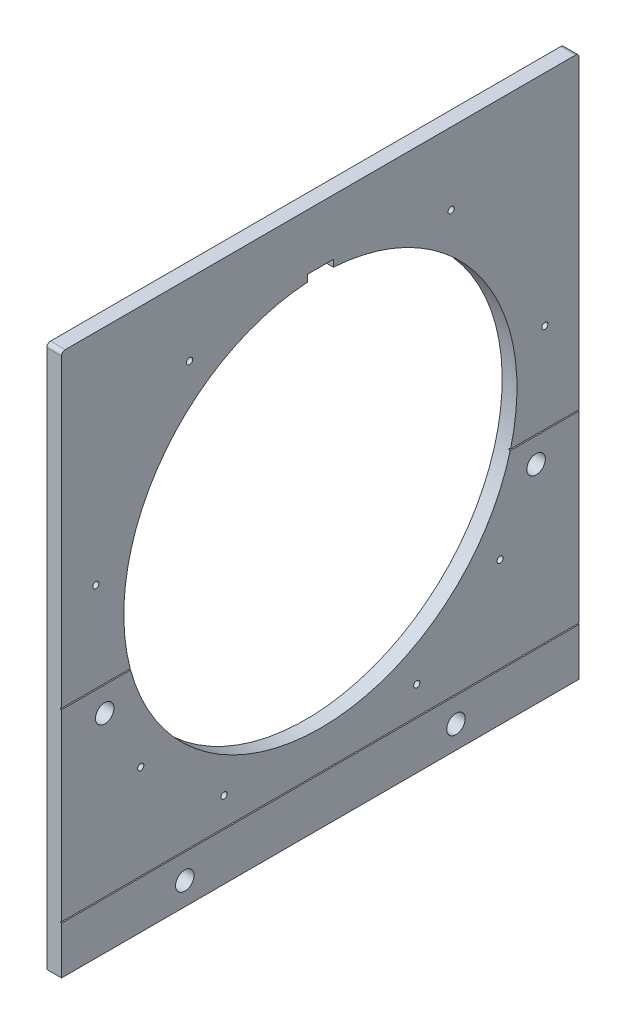
ISO-10303-21;
HEADER;
FILE_DESCRIPTION(('STEP AP214'),'2;1');
FILE_NAME('part.step','',(''),(''),'','','');
FILE_SCHEMA(('AUTOMOTIVE_DESIGN { 1 0 10303 214 1 1 1 1 }'));
ENDSEC;
DATA;
#1=APPLICATION_CONTEXT('core data for automotive mechanical design processes');
#2=APPLICATION_PROTOCOL_DEFINITION('international standard','automotive_design',2000,#1);
#3=PRODUCT_CONTEXT('',#1,'mechanical');
#4=PRODUCT('Part','Part','',(#3));
#5=PRODUCT_RELATED_PRODUCT_CATEGORY('part','',(#4));
#6=PRODUCT_DEFINITION_FORMATION('','',#4);
#7=PRODUCT_DEFINITION_CONTEXT('part definition',#1,'design');
#8=PRODUCT_DEFINITION('design','',#6,#7);
#9=PRODUCT_DEFINITION_SHAPE('','',#8);
#10=(LENGTH_UNIT() NAMED_UNIT(*) SI_UNIT(.MILLI.,.METRE.));
#11=(NAMED_UNIT(*) PLANE_ANGLE_UNIT() SI_UNIT($,.RADIAN.));
#12=(NAMED_UNIT(*) SI_UNIT($,.STERADIAN.) SOLID_ANGLE_UNIT());
#13=UNCERTAINTY_MEASURE_WITH_UNIT(LENGTH_MEASURE(1.E-05),#10,'distance_accuracy_value','');
#14=(GEOMETRIC_REPRESENTATION_CONTEXT(3) GLOBAL_UNCERTAINTY_ASSIGNED_CONTEXT((#13)) GLOBAL_UNIT_ASSIGNED_CONTEXT((#10,
#11,#12)) REPRESENTATION_CONTEXT('',''));
#15=CARTESIAN_POINT('',(0.,0.,0.));
#16=DIRECTION('',(0.,0.,1.));
#17=DIRECTION('',(1.,0.,0.));
#18=AXIS2_PLACEMENT_3D('',#15,#16,#17);
#19=CARTESIAN_POINT('',(0.,0.,0.));
#20=DIRECTION('',(-1.,0.,0.));
#21=DIRECTION('',(0.,0.,1.));
#22=AXIS2_PLACEMENT_3D('',#19,#20,#21);
#23=PLANE('',#22);
#24=CARTESIAN_POINT('',(0.,161.543128193462,106.111640724945));
#25=DIRECTION('',(1.,0.,0.));
#26=DIRECTION('',(0.,0.,-1.));
#27=AXIS2_PLACEMENT_3D('',#24,#25,#26);
#28=CIRCLE('',#27,2.50000000000001);
#29=CARTESIAN_POINT('',(0.,161.543128193462,103.611640724945));
#30=VERTEX_POINT('',#29);
#31=EDGE_CURVE('E817',#30,#30,#28,.T.);
#32=ORIENTED_EDGE('',*,*,#31,.F.);
#33=EDGE_LOOP('',(#32));
#34=FACE_BOUND('',#33,.T.);
#35=CARTESIAN_POINT('',(0.,42.1249128683808,182.189434307259));
#36=DIRECTION('',(1.,0.,0.));
#37=DIRECTION('',(0.,0.,-1.));
#38=AXIS2_PLACEMENT_3D('',#35,#36,#37);
#39=CIRCLE('',#38,2.5);
#40=CARTESIAN_POINT('',(0.,42.1249128683808,179.689434307259));
#41=VERTEX_POINT('',#40);
#42=EDGE_CURVE('E278',#41,#41,#39,.T.);
#43=ORIENTED_EDGE('',*,*,#42,.F.);
#44=EDGE_LOOP('',(#43));
#45=FACE_BOUND('',#44,.T.);
#46=CARTESIAN_POINT('',(0.,161.543128193462,-106.111640724945));
#47=DIRECTION('',(-1.,0.,0.));
#48=DIRECTION('',(0.,0.,1.));
#49=AXIS2_PLACEMENT_3D('',#46,#47,#48);
#50=CIRCLE('',#49,2.50000000000001);
#51=CARTESIAN_POINT('',(0.,161.543128193462,-103.611640724945));
#52=VERTEX_POINT('',#51);
#53=EDGE_CURVE('E292',#52,#52,#50,.T.);
#54=ORIENTED_EDGE('',*,*,#53,.T.);
#55=EDGE_LOOP('',(#54));
#56=FACE_BOUND('',#55,.T.);
#57=CARTESIAN_POINT('',(0.,42.1249128683808,-182.189434307259));
#58=DIRECTION('',(-1.,0.,0.));
#59=DIRECTION('',(0.,0.,1.));
#60=AXIS2_PLACEMENT_3D('',#57,#58,#59);
#61=CIRCLE('',#60,2.5);
#62=CARTESIAN_POINT('',(0.,42.1249128683808,-179.689434307259));
#63=VERTEX_POINT('',#62);
#64=EDGE_CURVE('E514',#63,#63,#61,.T.);
#65=ORIENTED_EDGE('',*,*,#64,.T.);
#66=EDGE_LOOP('',(#65));
#67=FACE_BOUND('',#66,.T.);
#68=DIRECTION('',(0.,-1.,0.));
#69=VECTOR('',#68,1.);
#70=CARTESIAN_POINT('',(0.,-220.,210.));
#71=LINE('',#70,#69);
#72=CARTESIAN_POINT('',(0.,217.,210.));
#73=VERTEX_POINT('',#72);
#74=CARTESIAN_POINT('',(0.,-30.5,210.));
#75=VERTEX_POINT('',#74);
#76=EDGE_CURVE('E429',#73,#75,#71,.T.);
#77=ORIENTED_EDGE('',*,*,#76,.T.);
#78=DIRECTION('',(0.,0.,1.));
#79=VECTOR('',#78,1.);
#80=CARTESIAN_POINT('',(0.,-30.5,210.));
#81=LINE('',#80,#79);
#82=CARTESIAN_POINT('',(0.,-30.5,154.272486205415));
#83=VERTEX_POINT('',#82);
#84=EDGE_CURVE('E424',#83,#75,#81,.T.);
#85=ORIENTED_EDGE('',*,*,#84,.F.);
#86=CARTESIAN_POINT('',(0.,9.99999999999998,0.));
#87=DIRECTION('',(1.,0.,0.));
#88=DIRECTION('',(0.,0.,-1.));
#89=AXIS2_PLACEMENT_3D('',#86,#87,#88);
#90=CIRCLE('',#89,159.5);
#91=CARTESIAN_POINT('',(0.,169.154013458662,10.5));
#92=VERTEX_POINT('',#91);
#93=EDGE_CURVE('E390',#92,#83,#90,.T.);
#94=ORIENTED_EDGE('',*,*,#93,.F.);
#95=DIRECTION('',(0.,-1.,0.));
#96=VECTOR('',#95,1.);
#97=CARTESIAN_POINT('',(0.,169.154013458662,10.5));
#98=LINE('',#97,#96);
#99=CARTESIAN_POINT('',(0.,174.654013458662,10.5));
#100=VERTEX_POINT('',#99);
#101=EDGE_CURVE('E779',#100,#92,#98,.T.);
#102=ORIENTED_EDGE('',*,*,#101,.F.);
#103=DIRECTION('',(0.,0.,1.));
#104=VECTOR('',#103,1.);
#105=CARTESIAN_POINT('',(0.,174.654013458662,-10.5));
#106=LINE('',#105,#104);
#107=CARTESIAN_POINT('',(0.,174.654013458662,-10.5));
#108=VERTEX_POINT('',#107);
#109=EDGE_CURVE('E797',#108,#100,#106,.T.);
#110=ORIENTED_EDGE('',*,*,#109,.F.);
#111=DIRECTION('',(0.,1.,0.));
#112=VECTOR('',#111,1.);
#113=CARTESIAN_POINT('',(0.,174.654013458662,-10.5));
#114=LINE('',#113,#112);
#115=CARTESIAN_POINT('',(0.,169.154013458662,-10.5));
#116=VERTEX_POINT('',#115);
#117=EDGE_CURVE('E277',#116,#108,#114,.T.);
#118=ORIENTED_EDGE('',*,*,#117,.F.);
#119=CARTESIAN_POINT('',(0.,-30.5,-154.272486205415));
#120=VERTEX_POINT('',#119);
#121=EDGE_CURVE('E400',#120,#116,#90,.T.);
#122=ORIENTED_EDGE('',*,*,#121,.F.);
#123=CARTESIAN_POINT('',(0.,-30.5,-210.));
#124=VERTEX_POINT('',#123);
#125=EDGE_CURVE('E208',#124,#120,#81,.T.);
#126=ORIENTED_EDGE('',*,*,#125,.F.);
#127=DIRECTION('',(0.,1.,0.));
#128=VECTOR('',#127,1.);
#129=CARTESIAN_POINT('',(0.,-220.,-210.));
#130=LINE('',#129,#128);
#131=CARTESIAN_POINT('',(0.,217.,-210.));
#132=VERTEX_POINT('',#131);
#133=EDGE_CURVE('E370',#124,#132,#130,.T.);
#134=ORIENTED_EDGE('',*,*,#133,.T.);
#135=CARTESIAN_POINT('',(0.,217.,-207.));
#136=DIRECTION('',(-1.,0.,0.));
#137=DIRECTION('',(0.,0.,1.));
#138=AXIS2_PLACEMENT_3D('',#135,#136,#137);
#139=CIRCLE('',#138,3.);
#140=CARTESIAN_POINT('',(0.,220.,-207.));
#141=VERTEX_POINT('',#140);
#142=EDGE_CURVE('E452',#132,#141,#139,.F.);
#143=ORIENTED_EDGE('',*,*,#142,.T.);
#144=DIRECTION('',(0.,0.,1.));
#145=VECTOR('',#144,1.);
#146=CARTESIAN_POINT('',(0.,220.,210.));
#147=LINE('',#146,#145);
#148=CARTESIAN_POINT('',(0.,220.,207.));
#149=VERTEX_POINT('',#148);
#150=EDGE_CURVE('E367',#141,#149,#147,.T.);
#151=ORIENTED_EDGE('',*,*,#150,.T.);
#152=CARTESIAN_POINT('',(0.,217.,207.));
#153=DIRECTION('',(-1.,0.,0.));
#154=DIRECTION('',(0.,0.,1.));
#155=AXIS2_PLACEMENT_3D('',#152,#153,#154);
#156=CIRCLE('',#155,3.);
#157=EDGE_CURVE('E449',#149,#73,#156,.F.);
#158=ORIENTED_EDGE('',*,*,#157,.T.);
#159=EDGE_LOOP('',(#77,#85,#94,#102,#110,#118,#122,#126,#134,#143,#151,#158));
#160=FACE_BOUND('',#159,.T.);
#161=ADVANCED_FACE('F42',(#34,#45,#56,#67,#160),#23,.F.);
#162=CARTESIAN_POINT('',(0.,-201.5,110.));
#163=DIRECTION('',(1.,0.,0.));
#164=DIRECTION('',(0.,0.,-1.));
#165=AXIS2_PLACEMENT_3D('',#162,#163,#164);
#166=CIRCLE('',#165,7.5);
#167=CARTESIAN_POINT('',(0.,-201.5,102.5));
#168=VERTEX_POINT('',#167);
#169=EDGE_CURVE('E265',#168,#168,#166,.T.);
#170=ORIENTED_EDGE('',*,*,#169,.F.);
#171=EDGE_LOOP('',(#170));
#172=FACE_BOUND('',#171,.T.);
#173=CARTESIAN_POINT('',(0.,-201.5,-110.));
#174=DIRECTION('',(-1.,0.,0.));
#175=DIRECTION('',(0.,0.,1.));
#176=AXIS2_PLACEMENT_3D('',#173,#174,#175);
#177=CIRCLE('',#176,7.5);
#178=CARTESIAN_POINT('',(0.,-201.5,-102.5));
#179=VERTEX_POINT('',#178);
#180=EDGE_CURVE('E355',#179,#179,#177,.T.);
#181=ORIENTED_EDGE('',*,*,#180,.T.);
#182=EDGE_LOOP('',(#181));
#183=FACE_BOUND('',#182,.T.);
#184=CARTESIAN_POINT('',(0.,-220.,-210.));
#185=VERTEX_POINT('',#184);
#186=CARTESIAN_POINT('',(0.,-181.5,-210.));
#187=VERTEX_POINT('',#186);
#188=EDGE_CURVE('E360',#185,#187,#130,.T.);
#189=ORIENTED_EDGE('',*,*,#188,.T.);
#190=DIRECTION('',(0.,0.,-1.));
#191=VECTOR('',#190,1.);
#192=CARTESIAN_POINT('',(0.,-181.5,-210.));
#193=LINE('',#192,#191);
#194=CARTESIAN_POINT('',(0.,-181.5,210.));
#195=VERTEX_POINT('',#194);
#196=EDGE_CURVE('E230',#195,#187,#193,.T.);
#197=ORIENTED_EDGE('',*,*,#196,.F.);
#198=CARTESIAN_POINT('',(0.,-220.,210.));
#199=VERTEX_POINT('',#198);
#200=EDGE_CURVE('E375',#195,#199,#71,.T.);
#201=ORIENTED_EDGE('',*,*,#200,.T.);
#202=DIRECTION('',(0.,0.,-1.));
#203=VECTOR('',#202,1.);
#204=CARTESIAN_POINT('',(0.,-220.,210.));
#205=LINE('',#204,#203);
#206=EDGE_CURVE('E363',#199,#185,#205,.T.);
#207=ORIENTED_EDGE('',*,*,#206,.T.);
#208=EDGE_LOOP('',(#189,#197,#201,#207));
#209=FACE_BOUND('',#208,.T.);
#210=ADVANCED_FACE('F346',(#172,#183,#209),#23,.F.);
#211=CARTESIAN_POINT('',(-12.,-220.,-210.));
#212=DIRECTION('',(0.,0.,-1.));
#213=DIRECTION('',(-1.,0.,0.));
#214=AXIS2_PLACEMENT_3D('',#211,#212,#213);
#215=PLANE('',#214);
#216=DIRECTION('',(1.,0.,0.));
#217=VECTOR('',#216,1.);
#218=CARTESIAN_POINT('',(-1.,-30.5,-210.));
#219=LINE('',#218,#217);
#220=CARTESIAN_POINT('',(-1.,-30.5,-210.));
#221=VERTEX_POINT('',#220);
#222=EDGE_CURVE('E219',#221,#124,#219,.T.);
#223=ORIENTED_EDGE('',*,*,#222,.F.);
#224=DIRECTION('',(0.,1.,0.));
#225=VECTOR('',#224,1.);
#226=CARTESIAN_POINT('',(-1.,-31.5,-210.));
#227=LINE('',#226,#225);
#228=CARTESIAN_POINT('',(-1.,-31.5,-210.));
#229=VERTEX_POINT('',#228);
#230=EDGE_CURVE('E196',#229,#221,#227,.T.);
#231=ORIENTED_EDGE('',*,*,#230,.F.);
#232=DIRECTION('',(1.,0.,0.));
#233=VECTOR('',#232,1.);
#234=CARTESIAN_POINT('',(-1.,-31.5,-210.));
#235=LINE('',#234,#233);
#236=CARTESIAN_POINT('',(0.,-31.5,-210.));
#237=VERTEX_POINT('',#236);
#238=EDGE_CURVE('E215',#229,#237,#235,.T.);
#239=ORIENTED_EDGE('',*,*,#238,.T.);
#240=CARTESIAN_POINT('',(0.,-180.5,-210.));
#241=VERTEX_POINT('',#240);
#242=EDGE_CURVE('E368',#241,#237,#130,.T.);
#243=ORIENTED_EDGE('',*,*,#242,.F.);
#244=DIRECTION('',(1.,0.,0.));
#245=VECTOR('',#244,1.);
#246=CARTESIAN_POINT('',(-1.,-180.5,-210.));
#247=LINE('',#246,#245);
#248=CARTESIAN_POINT('',(-1.,-180.5,-210.));
#249=VERTEX_POINT('',#248);
#250=EDGE_CURVE('E57',#249,#241,#247,.T.);
#251=ORIENTED_EDGE('',*,*,#250,.F.);
#252=DIRECTION('',(0.,1.,0.));
#253=VECTOR('',#252,1.);
#254=CARTESIAN_POINT('',(-1.,-181.5,-210.));
#255=LINE('',#254,#253);
#256=CARTESIAN_POINT('',(-1.,-181.5,-210.));
#257=VERTEX_POINT('',#256);
#258=EDGE_CURVE('E224',#257,#249,#255,.T.);
#259=ORIENTED_EDGE('',*,*,#258,.F.);
#260=DIRECTION('',(1.,0.,0.));
#261=VECTOR('',#260,1.);
#262=CARTESIAN_POINT('',(-1.,-181.5,-210.));
#263=LINE('',#262,#261);
#264=EDGE_CURVE('E585',#257,#187,#263,.T.);
#265=ORIENTED_EDGE('',*,*,#264,.T.);
#266=ORIENTED_EDGE('',*,*,#188,.F.);
#267=DIRECTION('',(1.,0.,0.));
#268=VECTOR('',#267,1.);
#269=CARTESIAN_POINT('',(-12.,-220.,-210.));
#270=LINE('',#269,#268);
#271=CARTESIAN_POINT('',(-12.,-220.,-210.));
#272=VERTEX_POINT('',#271);
#273=EDGE_CURVE('E440',#272,#185,#270,.T.);
#274=ORIENTED_EDGE('',*,*,#273,.F.);
#275=DIRECTION('',(0.,1.,0.));
#276=VECTOR('',#275,1.);
#277=CARTESIAN_POINT('',(-12.,-220.,-210.));
#278=LINE('',#277,#276);
#279=CARTESIAN_POINT('',(-12.,217.,-210.));
#280=VERTEX_POINT('',#279);
#281=EDGE_CURVE('E406',#272,#280,#278,.T.);
#282=ORIENTED_EDGE('',*,*,#281,.T.);
#283=DIRECTION('',(1.,0.,0.));
#284=VECTOR('',#283,1.);
#285=CARTESIAN_POINT('',(-12.,217.,-210.));
#286=LINE('',#285,#284);
#287=EDGE_CURVE('E442',#280,#132,#286,.T.);
#288=ORIENTED_EDGE('',*,*,#287,.T.);
#289=ORIENTED_EDGE('',*,*,#133,.F.);
#290=EDGE_LOOP('',(#223,#231,#239,#243,#251,#259,#265,#266,#274,#282,#288,#289));
#291=FACE_BOUND('',#290,.T.);
#292=ADVANCED_FACE('F349',(#291),#215,.T.);
#293=CARTESIAN_POINT('',(-12.,-220.,210.));
#294=DIRECTION('',(0.,-1.,0.));
#295=DIRECTION('',(0.,0.,-1.));
#296=AXIS2_PLACEMENT_3D('',#293,#294,#295);
#297=PLANE('',#296);
#298=ORIENTED_EDGE('',*,*,#206,.F.);
#299=DIRECTION('',(1.,0.,0.));
#300=VECTOR('',#299,1.);
#301=CARTESIAN_POINT('',(-12.,-220.,210.));
#302=LINE('',#301,#300);
#303=CARTESIAN_POINT('',(-12.,-220.,210.));
#304=VERTEX_POINT('',#303);
#305=EDGE_CURVE('E443',#304,#199,#302,.T.);
#306=ORIENTED_EDGE('',*,*,#305,.F.);
#307=DIRECTION('',(0.,0.,-1.));
#308=VECTOR('',#307,1.);
#309=CARTESIAN_POINT('',(-12.,-220.,210.));
#310=LINE('',#309,#308);
#311=EDGE_CURVE('E446',#304,#272,#310,.T.);
#312=ORIENTED_EDGE('',*,*,#311,.T.);
#313=ORIENTED_EDGE('',*,*,#273,.T.);
#314=EDGE_LOOP('',(#298,#306,#312,#313));
#315=FACE_BOUND('',#314,.T.);
#316=ADVANCED_FACE('F872',(#315),#297,.T.);
#317=CARTESIAN_POINT('',(-12.,-220.,210.));
#318=DIRECTION('',(0.,0.,1.));
#319=DIRECTION('',(1.,0.,0.));
#320=AXIS2_PLACEMENT_3D('',#317,#318,#319);
#321=PLANE('',#320);
#322=DIRECTION('',(1.,0.,0.));
#323=VECTOR('',#322,1.);
#324=CARTESIAN_POINT('',(-1.,-30.5,210.));
#325=LINE('',#324,#323);
#326=CARTESIAN_POINT('',(-1.,-30.5,210.));
#327=VERTEX_POINT('',#326);
#328=EDGE_CURVE('E427',#327,#75,#325,.T.);
#329=ORIENTED_EDGE('',*,*,#328,.T.);
#330=ORIENTED_EDGE('',*,*,#76,.F.);
#331=DIRECTION('',(1.,0.,0.));
#332=VECTOR('',#331,1.);
#333=CARTESIAN_POINT('',(-12.,217.,210.));
#334=LINE('',#333,#332);
#335=CARTESIAN_POINT('',(-12.,217.,210.));
#336=VERTEX_POINT('',#335);
#337=EDGE_CURVE('E463',#73,#336,#334,.F.);
#338=ORIENTED_EDGE('',*,*,#337,.T.);
#339=DIRECTION('',(0.,-1.,0.));
#340=VECTOR('',#339,1.);
#341=CARTESIAN_POINT('',(-12.,-220.,210.));
#342=LINE('',#341,#340);
#343=EDGE_CURVE('E864',#336,#304,#342,.T.);
#344=ORIENTED_EDGE('',*,*,#343,.T.);
#345=ORIENTED_EDGE('',*,*,#305,.T.);
#346=ORIENTED_EDGE('',*,*,#200,.F.);
#347=DIRECTION('',(1.,0.,0.));
#348=VECTOR('',#347,1.);
#349=CARTESIAN_POINT('',(-1.,-181.5,210.));
#350=LINE('',#349,#348);
#351=CARTESIAN_POINT('',(-1.,-181.5,210.));
#352=VERTEX_POINT('',#351);
#353=EDGE_CURVE('E588',#352,#195,#350,.T.);
#354=ORIENTED_EDGE('',*,*,#353,.F.);
#355=DIRECTION('',(0.,-1.,0.));
#356=VECTOR('',#355,1.);
#357=CARTESIAN_POINT('',(-1.,-181.5,210.));
#358=LINE('',#357,#356);
#359=CARTESIAN_POINT('',(-1.,-180.5,210.));
#360=VERTEX_POINT('',#359);
#361=EDGE_CURVE('E242',#360,#352,#358,.T.);
#362=ORIENTED_EDGE('',*,*,#361,.F.);
#363=DIRECTION('',(1.,0.,0.));
#364=VECTOR('',#363,1.);
#365=CARTESIAN_POINT('',(-1.,-180.5,210.));
#366=LINE('',#365,#364);
#367=CARTESIAN_POINT('',(0.,-180.5,210.));
#368=VERTEX_POINT('',#367);
#369=EDGE_CURVE('E589',#360,#368,#366,.T.);
#370=ORIENTED_EDGE('',*,*,#369,.T.);
#371=CARTESIAN_POINT('',(0.,-31.5,210.));
#372=VERTEX_POINT('',#371);
#373=EDGE_CURVE('E214',#372,#368,#71,.T.);
#374=ORIENTED_EDGE('',*,*,#373,.F.);
#375=DIRECTION('',(1.,0.,0.));
#376=VECTOR('',#375,1.);
#377=CARTESIAN_POINT('',(-1.,-31.5,210.));
#378=LINE('',#377,#376);
#379=CARTESIAN_POINT('',(-1.,-31.5,210.));
#380=VERTEX_POINT('',#379);
#381=EDGE_CURVE('E191',#380,#372,#378,.T.);
#382=ORIENTED_EDGE('',*,*,#381,.F.);
#383=DIRECTION('',(0.,-1.,0.));
#384=VECTOR('',#383,1.);
#385=CARTESIAN_POINT('',(-1.,-31.5,210.));
#386=LINE('',#385,#384);
#387=EDGE_CURVE('E200',#327,#380,#386,.T.);
#388=ORIENTED_EDGE('',*,*,#387,.F.);
#389=EDGE_LOOP('',(#329,#330,#338,#344,#345,#346,#354,#362,#370,#374,#382,#388));
#390=FACE_BOUND('',#389,.T.);
#391=ADVANCED_FACE('F211',(#390),#321,.T.);
#392=CARTESIAN_POINT('',(-12.,220.,210.));
#393=DIRECTION('',(0.,1.,0.));
#394=DIRECTION('',(0.,0.,1.));
#395=AXIS2_PLACEMENT_3D('',#392,#393,#394);
#396=PLANE('',#395);
#397=ORIENTED_EDGE('',*,*,#150,.F.);
#398=DIRECTION('',(1.,0.,0.));
#399=VECTOR('',#398,1.);
#400=CARTESIAN_POINT('',(-12.,220.,-207.));
#401=LINE('',#400,#399);
#402=CARTESIAN_POINT('',(-12.,220.,-207.));
#403=VERTEX_POINT('',#402);
#404=EDGE_CURVE('E457',#141,#403,#401,.F.);
#405=ORIENTED_EDGE('',*,*,#404,.T.);
#406=DIRECTION('',(0.,0.,1.));
#407=VECTOR('',#406,1.);
#408=CARTESIAN_POINT('',(-12.,220.,210.));
#409=LINE('',#408,#407);
#410=CARTESIAN_POINT('',(-12.,220.,207.));
#411=VERTEX_POINT('',#410);
#412=EDGE_CURVE('E861',#403,#411,#409,.T.);
#413=ORIENTED_EDGE('',*,*,#412,.T.);
#414=DIRECTION('',(1.,0.,0.));
#415=VECTOR('',#414,1.);
#416=CARTESIAN_POINT('',(-12.,220.,207.));
#417=LINE('',#416,#415);
#418=EDGE_CURVE('E454',#411,#149,#417,.T.);
#419=ORIENTED_EDGE('',*,*,#418,.T.);
#420=EDGE_LOOP('',(#397,#405,#413,#419));
#421=FACE_BOUND('',#420,.T.);
#422=ADVANCED_FACE('F528',(#421),#396,.T.);
#423=CARTESIAN_POINT('',(-12.,0.,0.));
#424=DIRECTION('',(-1.,0.,0.));
#425=DIRECTION('',(0.,0.,1.));
#426=AXIS2_PLACEMENT_3D('',#423,#424,#425);
#427=PLANE('',#426);
#428=CARTESIAN_POINT('',(-12.,-51.5,-175.));
#429=DIRECTION('',(-1.,0.,0.));
#430=DIRECTION('',(0.,0.,1.));
#431=AXIS2_PLACEMENT_3D('',#428,#429,#430);
#432=CIRCLE('',#431,7.50000000000001);
#433=CARTESIAN_POINT('',(-12.,-51.5,-167.5));
#434=VERTEX_POINT('',#433);
#435=EDGE_CURVE('E321',#434,#434,#432,.T.);
#436=ORIENTED_EDGE('',*,*,#435,.F.);
#437=EDGE_LOOP('',(#436));
#438=FACE_BOUND('',#437,.T.);
#439=CARTESIAN_POINT('',(-12.,-201.5,-110.));
#440=DIRECTION('',(-1.,0.,0.));
#441=DIRECTION('',(0.,0.,1.));
#442=AXIS2_PLACEMENT_3D('',#439,#440,#441);
#443=CIRCLE('',#442,7.5);
#444=CARTESIAN_POINT('',(-12.,-201.5,-102.5));
#445=VERTEX_POINT('',#444);
#446=EDGE_CURVE('E507',#445,#445,#443,.T.);
#447=ORIENTED_EDGE('',*,*,#446,.F.);
#448=EDGE_LOOP('',(#447));
#449=FACE_BOUND('',#448,.T.);
#450=CARTESIAN_POINT('',(-12.,42.1249128683808,-182.189434307259));
#451=DIRECTION('',(-1.,0.,0.));
#452=DIRECTION('',(0.,0.,1.));
#453=AXIS2_PLACEMENT_3D('',#450,#451,#452);
#454=CIRCLE('',#453,2.5);
#455=CARTESIAN_POINT('',(-12.,42.1249128683808,-179.689434307259));
#456=VERTEX_POINT('',#455);
#457=EDGE_CURVE('E272',#456,#456,#454,.T.);
#458=ORIENTED_EDGE('',*,*,#457,.F.);
#459=EDGE_LOOP('',(#458));
#460=FACE_BOUND('',#459,.T.);
#461=CARTESIAN_POINT('',(-12.,161.543128193462,-106.111640724945));
#462=DIRECTION('',(-1.,0.,0.));
#463=DIRECTION('',(0.,0.,1.));
#464=AXIS2_PLACEMENT_3D('',#461,#462,#463);
#465=CIRCLE('',#464,2.50000000000001);
#466=CARTESIAN_POINT('',(-12.,161.543128193462,-103.611640724945));
#467=VERTEX_POINT('',#466);
#468=EDGE_CURVE('E298',#467,#467,#465,.T.);
#469=ORIENTED_EDGE('',*,*,#468,.F.);
#470=EDGE_LOOP('',(#469));
#471=FACE_BOUND('',#470,.T.);
#472=CARTESIAN_POINT('',(-12.,-103.897372935247,-145.781989417243));
#473=DIRECTION('',(-1.,0.,0.));
#474=DIRECTION('',(0.,0.,1.));
#475=AXIS2_PLACEMENT_3D('',#472,#473,#474);
#476=CIRCLE('',#475,2.5);
#477=CARTESIAN_POINT('',(-12.,-103.897372935247,-143.281989417243));
#478=VERTEX_POINT('',#477);
#479=EDGE_CURVE('E299',#478,#478,#476,.T.);
#480=ORIENTED_EDGE('',*,*,#479,.F.);
#481=EDGE_LOOP('',(#480));
#482=FACE_BOUND('',#481,.T.);
#483=CARTESIAN_POINT('',(-12.,-157.66694060178,-78.1843784220302));
#484=DIRECTION('',(-1.,0.,0.));
#485=DIRECTION('',(0.,0.,1.));
#486=AXIS2_PLACEMENT_3D('',#483,#484,#485);
#487=CIRCLE('',#486,2.5);
#488=CARTESIAN_POINT('',(-12.,-157.66694060178,-75.6843784220302));
#489=VERTEX_POINT('',#488);
#490=EDGE_CURVE('E307',#489,#489,#487,.T.);
#491=ORIENTED_EDGE('',*,*,#490,.F.);
#492=EDGE_LOOP('',(#491));
#493=FACE_BOUND('',#492,.T.);
#494=CARTESIAN_POINT('',(-12.,-51.5,175.));
#495=DIRECTION('',(1.,0.,0.));
#496=DIRECTION('',(0.,0.,-1.));
#497=AXIS2_PLACEMENT_3D('',#494,#495,#496);
#498=CIRCLE('',#497,7.50000000000001);
#499=CARTESIAN_POINT('',(-12.,-51.5,167.5));
#500=VERTEX_POINT('',#499);
#501=EDGE_CURVE('E322',#500,#500,#498,.T.);
#502=ORIENTED_EDGE('',*,*,#501,.T.);
#503=EDGE_LOOP('',(#502));
#504=FACE_BOUND('',#503,.T.);
#505=CARTESIAN_POINT('',(-12.,-201.5,110.));
#506=DIRECTION('',(1.,0.,0.));
#507=DIRECTION('',(0.,0.,-1.));
#508=AXIS2_PLACEMENT_3D('',#505,#506,#507);
#509=CIRCLE('',#508,7.5);
#510=CARTESIAN_POINT('',(-12.,-201.5,102.5));
#511=VERTEX_POINT('',#510);
#512=EDGE_CURVE('E271',#511,#511,#509,.T.);
#513=ORIENTED_EDGE('',*,*,#512,.T.);
#514=EDGE_LOOP('',(#513));
#515=FACE_BOUND('',#514,.T.);
#516=CARTESIAN_POINT('',(-12.,42.1249128683808,182.189434307259));
#517=DIRECTION('',(1.,0.,0.));
#518=DIRECTION('',(0.,0.,-1.));
#519=AXIS2_PLACEMENT_3D('',#516,#517,#518);
#520=CIRCLE('',#519,2.5);
#521=CARTESIAN_POINT('',(-12.,42.1249128683808,179.689434307259));
#522=VERTEX_POINT('',#521);
#523=EDGE_CURVE('E274',#522,#522,#520,.T.);
#524=ORIENTED_EDGE('',*,*,#523,.T.);
#525=EDGE_LOOP('',(#524));
#526=FACE_BOUND('',#525,.T.);
#527=CARTESIAN_POINT('',(-12.,161.543128193462,106.111640724945));
#528=DIRECTION('',(1.,0.,0.));
#529=DIRECTION('',(0.,0.,-1.));
#530=AXIS2_PLACEMENT_3D('',#527,#528,#529);
#531=CIRCLE('',#530,2.50000000000001);
#532=CARTESIAN_POINT('',(-12.,161.543128193462,103.611640724945));
#533=VERTEX_POINT('',#532);
#534=EDGE_CURVE('E283',#533,#533,#531,.T.);
#535=ORIENTED_EDGE('',*,*,#534,.T.);
#536=EDGE_LOOP('',(#535));
#537=FACE_BOUND('',#536,.T.);
#538=CARTESIAN_POINT('',(-12.,-103.897372935247,145.781989417243));
#539=DIRECTION('',(1.,0.,0.));
#540=DIRECTION('',(0.,0.,-1.));
#541=AXIS2_PLACEMENT_3D('',#538,#539,#540);
#542=CIRCLE('',#541,2.5);
#543=CARTESIAN_POINT('',(-12.,-103.897372935247,143.281989417243));
#544=VERTEX_POINT('',#543);
#545=EDGE_CURVE('E815',#544,#544,#542,.T.);
#546=ORIENTED_EDGE('',*,*,#545,.T.);
#547=EDGE_LOOP('',(#546));
#548=FACE_BOUND('',#547,.T.);
#549=CARTESIAN_POINT('',(-12.,-157.66694060178,78.1843784220302));
#550=DIRECTION('',(1.,0.,0.));
#551=DIRECTION('',(0.,0.,-1.));
#552=AXIS2_PLACEMENT_3D('',#549,#550,#551);
#553=CIRCLE('',#552,2.5);
#554=CARTESIAN_POINT('',(-12.,-157.66694060178,75.6843784220302));
#555=VERTEX_POINT('',#554);
#556=EDGE_CURVE('E808',#555,#555,#553,.T.);
#557=ORIENTED_EDGE('',*,*,#556,.T.);
#558=EDGE_LOOP('',(#557));
#559=FACE_BOUND('',#558,.T.);
#560=DIRECTION('',(0.,-1.,0.));
#561=VECTOR('',#560,1.);
#562=CARTESIAN_POINT('',(-12.,169.154013458662,10.5));
#563=LINE('',#562,#561);
#564=CARTESIAN_POINT('',(-12.,174.654013458662,10.5));
#565=VERTEX_POINT('',#564);
#566=CARTESIAN_POINT('',(-12.,169.154013458662,10.5));
#567=VERTEX_POINT('',#566);
#568=EDGE_CURVE('E786',#565,#567,#563,.T.);
#569=ORIENTED_EDGE('',*,*,#568,.T.);
#570=CARTESIAN_POINT('',(-12.,9.99999999999998,0.));
#571=DIRECTION('',(1.,0.,0.));
#572=DIRECTION('',(0.,0.,-1.));
#573=AXIS2_PLACEMENT_3D('',#570,#571,#572);
#574=CIRCLE('',#573,159.5);
#575=CARTESIAN_POINT('',(-12.,169.154013458662,-10.5));
#576=VERTEX_POINT('',#575);
#577=EDGE_CURVE('E382',#567,#576,#574,.T.);
#578=ORIENTED_EDGE('',*,*,#577,.T.);
#579=DIRECTION('',(0.,1.,0.));
#580=VECTOR('',#579,1.);
#581=CARTESIAN_POINT('',(-12.,174.654013458662,-10.5));
#582=LINE('',#581,#580);
#583=CARTESIAN_POINT('',(-12.,174.654013458662,-10.5));
#584=VERTEX_POINT('',#583);
#585=EDGE_CURVE('E793',#576,#584,#582,.T.);
#586=ORIENTED_EDGE('',*,*,#585,.T.);
#587=DIRECTION('',(0.,0.,1.));
#588=VECTOR('',#587,1.);
#589=CARTESIAN_POINT('',(-12.,174.654013458662,-10.5));
#590=LINE('',#589,#588);
#591=EDGE_CURVE('E789',#584,#565,#590,.T.);
#592=ORIENTED_EDGE('',*,*,#591,.T.);
#593=EDGE_LOOP('',(#569,#578,#586,#592));
#594=FACE_BOUND('',#593,.T.);
#595=ORIENTED_EDGE('',*,*,#412,.F.);
#596=CARTESIAN_POINT('',(-12.,217.,-207.));
#597=DIRECTION('',(-1.,0.,0.));
#598=DIRECTION('',(0.,0.,1.));
#599=AXIS2_PLACEMENT_3D('',#596,#597,#598);
#600=CIRCLE('',#599,3.);
#601=EDGE_CURVE('E461',#403,#280,#600,.T.);
#602=ORIENTED_EDGE('',*,*,#601,.T.);
#603=ORIENTED_EDGE('',*,*,#281,.F.);
#604=ORIENTED_EDGE('',*,*,#311,.F.);
#605=ORIENTED_EDGE('',*,*,#343,.F.);
#606=CARTESIAN_POINT('',(-12.,217.,207.));
#607=DIRECTION('',(-1.,0.,0.));
#608=DIRECTION('',(0.,0.,1.));
#609=AXIS2_PLACEMENT_3D('',#606,#607,#608);
#610=CIRCLE('',#609,3.);
#611=EDGE_CURVE('E459',#336,#411,#610,.T.);
#612=ORIENTED_EDGE('',*,*,#611,.T.);
#613=EDGE_LOOP('',(#595,#602,#603,#604,#605,#612));
#614=FACE_BOUND('',#613,.T.);
#615=ADVANCED_FACE('F335',(#438,#449,#460,#471,#482,#493,#504,#515,#526,#537,#548,#559,#594,
#614),#427,.T.);
#616=CARTESIAN_POINT('',(0.,-51.5,-175.));
#617=DIRECTION('',(-1.,0.,0.));
#618=DIRECTION('',(0.,0.,1.));
#619=AXIS2_PLACEMENT_3D('',#616,#617,#618);
#620=CIRCLE('',#619,7.50000000000001);
#621=CARTESIAN_POINT('',(0.,-51.5,-167.5));
#622=VERTEX_POINT('',#621);
#623=EDGE_CURVE('E509',#622,#622,#620,.T.);
#624=ORIENTED_EDGE('',*,*,#623,.T.);
#625=EDGE_LOOP('',(#624));
#626=FACE_BOUND('',#625,.T.);
#627=CARTESIAN_POINT('',(0.,-103.897372935247,-145.781989417243));
#628=DIRECTION('',(-1.,0.,0.));
#629=DIRECTION('',(0.,0.,1.));
#630=AXIS2_PLACEMENT_3D('',#627,#628,#629);
#631=CIRCLE('',#630,2.5);
#632=CARTESIAN_POINT('',(0.,-103.897372935247,-143.281989417243));
#633=VERTEX_POINT('',#632);
#634=EDGE_CURVE('E302',#633,#633,#631,.T.);
#635=ORIENTED_EDGE('',*,*,#634,.T.);
#636=EDGE_LOOP('',(#635));
#637=FACE_BOUND('',#636,.T.);
#638=CARTESIAN_POINT('',(0.,-157.66694060178,-78.1843784220302));
#639=DIRECTION('',(-1.,0.,0.));
#640=DIRECTION('',(0.,0.,1.));
#641=AXIS2_PLACEMENT_3D('',#638,#639,#640);
#642=CIRCLE('',#641,2.5);
#643=CARTESIAN_POINT('',(0.,-157.66694060178,-75.6843784220302));
#644=VERTEX_POINT('',#643);
#645=EDGE_CURVE('E316',#644,#644,#642,.T.);
#646=ORIENTED_EDGE('',*,*,#645,.T.);
#647=EDGE_LOOP('',(#646));
#648=FACE_BOUND('',#647,.T.);
#649=CARTESIAN_POINT('',(0.,-51.5,175.));
#650=DIRECTION('',(1.,0.,0.));
#651=DIRECTION('',(0.,0.,-1.));
#652=AXIS2_PLACEMENT_3D('',#649,#650,#651);
#653=CIRCLE('',#652,7.50000000000001);
#654=CARTESIAN_POINT('',(0.,-51.5,167.5));
#655=VERTEX_POINT('',#654);
#656=EDGE_CURVE('E325',#655,#655,#653,.T.);
#657=ORIENTED_EDGE('',*,*,#656,.F.);
#658=EDGE_LOOP('',(#657));
#659=FACE_BOUND('',#658,.T.);
#660=CARTESIAN_POINT('',(0.,-103.897372935247,145.781989417243));
#661=DIRECTION('',(1.,0.,0.));
#662=DIRECTION('',(0.,0.,-1.));
#663=AXIS2_PLACEMENT_3D('',#660,#661,#662);
#664=CIRCLE('',#663,2.5);
#665=CARTESIAN_POINT('',(0.,-103.897372935247,143.281989417243));
#666=VERTEX_POINT('',#665);
#667=EDGE_CURVE('E574',#666,#666,#664,.T.);
#668=ORIENTED_EDGE('',*,*,#667,.F.);
#669=EDGE_LOOP('',(#668));
#670=FACE_BOUND('',#669,.T.);
#671=CARTESIAN_POINT('',(0.,-157.66694060178,78.1843784220302));
#672=DIRECTION('',(1.,0.,0.));
#673=DIRECTION('',(0.,0.,-1.));
#674=AXIS2_PLACEMENT_3D('',#671,#672,#673);
#675=CIRCLE('',#674,2.5);
#676=CARTESIAN_POINT('',(0.,-157.66694060178,75.6843784220302));
#677=VERTEX_POINT('',#676);
#678=EDGE_CURVE('E324',#677,#677,#675,.T.);
#679=ORIENTED_EDGE('',*,*,#678,.F.);
#680=EDGE_LOOP('',(#679));
#681=FACE_BOUND('',#680,.T.);
#682=ORIENTED_EDGE('',*,*,#242,.T.);
#683=DIRECTION('',(0.,0.,-1.));
#684=VECTOR('',#683,1.);
#685=CARTESIAN_POINT('',(0.,-31.5,210.));
#686=LINE('',#685,#684);
#687=CARTESIAN_POINT('',(0.,-31.5,-154.006493369598));
#688=VERTEX_POINT('',#687);
#689=EDGE_CURVE('E580',#688,#237,#686,.T.);
#690=ORIENTED_EDGE('',*,*,#689,.F.);
#691=CARTESIAN_POINT('',(0.,-31.5,154.006493369598));
#692=VERTEX_POINT('',#691);
#693=EDGE_CURVE('E398',#692,#688,#90,.T.);
#694=ORIENTED_EDGE('',*,*,#693,.F.);
#695=EDGE_CURVE('E425',#372,#692,#686,.T.);
#696=ORIENTED_EDGE('',*,*,#695,.F.);
#697=ORIENTED_EDGE('',*,*,#373,.T.);
#698=DIRECTION('',(0.,0.,1.));
#699=VECTOR('',#698,1.);
#700=CARTESIAN_POINT('',(0.,-180.5,-210.));
#701=LINE('',#700,#699);
#702=EDGE_CURVE('E250',#241,#368,#701,.T.);
#703=ORIENTED_EDGE('',*,*,#702,.F.);
#704=EDGE_LOOP('',(#682,#690,#694,#696,#697,#703));
#705=FACE_BOUND('',#704,.T.);
#706=ADVANCED_FACE('F351',(#626,#637,#648,#659,#670,#681,#705),#23,.F.);
#707=CARTESIAN_POINT('',(-12.,9.99999999999998,0.));
#708=DIRECTION('',(1.,0.,0.));
#709=DIRECTION('',(0.,0.,-1.));
#710=AXIS2_PLACEMENT_3D('',#707,#708,#709);
#711=CYLINDRICAL_SURFACE('',#710,159.5);
#712=ORIENTED_EDGE('',*,*,#93,.T.);
#713=DIRECTION('',(1.,0.,0.));
#714=VECTOR('',#713,1.);
#715=CARTESIAN_POINT('',(-12.,-30.5,154.272486205415));
#716=LINE('',#715,#714);
#717=CARTESIAN_POINT('',(-1.,-30.5,154.272486205415));
#718=VERTEX_POINT('',#717);
#719=EDGE_CURVE('E12',#83,#718,#716,.F.);
#720=ORIENTED_EDGE('',*,*,#719,.T.);
#721=CARTESIAN_POINT('',(-1.,9.99999999999998,0.));
#722=DIRECTION('',(-1.,0.,0.));
#723=DIRECTION('',(0.,0.,1.));
#724=AXIS2_PLACEMENT_3D('',#721,#722,#723);
#725=CIRCLE('',#724,159.5);
#726=CARTESIAN_POINT('',(-1.,-31.5,154.006493369598));
#727=VERTEX_POINT('',#726);
#728=EDGE_CURVE('E470',#718,#727,#725,.F.);
#729=ORIENTED_EDGE('',*,*,#728,.T.);
#730=DIRECTION('',(1.,0.,0.));
#731=VECTOR('',#730,1.);
#732=CARTESIAN_POINT('',(-12.,-31.5,154.006493369598));
#733=LINE('',#732,#731);
#734=EDGE_CURVE('E50',#727,#692,#733,.T.);
#735=ORIENTED_EDGE('',*,*,#734,.T.);
#736=ORIENTED_EDGE('',*,*,#693,.T.);
#737=DIRECTION('',(1.,0.,0.));
#738=VECTOR('',#737,1.);
#739=CARTESIAN_POINT('',(-12.,-31.5,-154.006493369598));
#740=LINE('',#739,#738);
#741=CARTESIAN_POINT('',(-1.,-31.5,-154.006493369598));
#742=VERTEX_POINT('',#741);
#743=EDGE_CURVE('E469',#688,#742,#740,.F.);
#744=ORIENTED_EDGE('',*,*,#743,.T.);
#745=CARTESIAN_POINT('',(-1.,-30.5,-154.272486205415));
#746=VERTEX_POINT('',#745);
#747=EDGE_CURVE('E465',#742,#746,#725,.F.);
#748=ORIENTED_EDGE('',*,*,#747,.T.);
#749=DIRECTION('',(1.,0.,0.));
#750=VECTOR('',#749,1.);
#751=CARTESIAN_POINT('',(-12.,-30.5,-154.272486205415));
#752=LINE('',#751,#750);
#753=EDGE_CURVE('E473',#746,#120,#752,.T.);
#754=ORIENTED_EDGE('',*,*,#753,.T.);
#755=ORIENTED_EDGE('',*,*,#121,.T.);
#756=DIRECTION('',(1.,0.,0.));
#757=VECTOR('',#756,1.);
#758=CARTESIAN_POINT('',(-12.,169.154013458662,-10.5));
#759=LINE('',#758,#757);
#760=EDGE_CURVE('E402',#576,#116,#759,.T.);
#761=ORIENTED_EDGE('',*,*,#760,.F.);
#762=ORIENTED_EDGE('',*,*,#577,.F.);
#763=DIRECTION('',(1.,0.,0.));
#764=VECTOR('',#763,1.);
#765=CARTESIAN_POINT('',(-12.,169.154013458662,10.5));
#766=LINE('',#765,#764);
#767=EDGE_CURVE('E767',#567,#92,#766,.T.);
#768=ORIENTED_EDGE('',*,*,#767,.T.);
#769=EDGE_LOOP('',(#712,#720,#729,#735,#736,#744,#748,#754,#755,#761,#762,#768));
#770=FACE_BOUND('',#769,.T.);
#771=ADVANCED_FACE('F480',(#770),#711,.F.);
#772=CARTESIAN_POINT('',(-12.,169.154013458662,10.5));
#773=DIRECTION('',(0.,0.,1.));
#774=DIRECTION('',(0.,-1.,0.));
#775=AXIS2_PLACEMENT_3D('',#772,#773,#774);
#776=PLANE('',#775);
#777=ORIENTED_EDGE('',*,*,#101,.T.);
#778=ORIENTED_EDGE('',*,*,#767,.F.);
#779=ORIENTED_EDGE('',*,*,#568,.F.);
#780=DIRECTION('',(1.,0.,0.));
#781=VECTOR('',#780,1.);
#782=CARTESIAN_POINT('',(-12.,174.654013458662,10.5));
#783=LINE('',#782,#781);
#784=EDGE_CURVE('E773',#565,#100,#783,.T.);
#785=ORIENTED_EDGE('',*,*,#784,.T.);
#786=EDGE_LOOP('',(#777,#778,#779,#785));
#787=FACE_BOUND('',#786,.T.);
#788=ADVANCED_FACE('F561',(#787),#776,.F.);
#789=CARTESIAN_POINT('',(-12.,174.654013458662,-10.5));
#790=DIRECTION('',(0.,1.,0.));
#791=DIRECTION('',(0.,0.,1.));
#792=AXIS2_PLACEMENT_3D('',#789,#790,#791);
#793=PLANE('',#792);
#794=ORIENTED_EDGE('',*,*,#109,.T.);
#795=ORIENTED_EDGE('',*,*,#784,.F.);
#796=ORIENTED_EDGE('',*,*,#591,.F.);
#797=DIRECTION('',(1.,0.,0.));
#798=VECTOR('',#797,1.);
#799=CARTESIAN_POINT('',(-12.,174.654013458662,-10.5));
#800=LINE('',#799,#798);
#801=EDGE_CURVE('E776',#584,#108,#800,.T.);
#802=ORIENTED_EDGE('',*,*,#801,.T.);
#803=EDGE_LOOP('',(#794,#795,#796,#802));
#804=FACE_BOUND('',#803,.T.);
#805=ADVANCED_FACE('F847',(#804),#793,.F.);
#806=CARTESIAN_POINT('',(-12.,174.654013458662,-10.5));
#807=DIRECTION('',(0.,0.,-1.));
#808=DIRECTION('',(0.,1.,0.));
#809=AXIS2_PLACEMENT_3D('',#806,#807,#808);
#810=PLANE('',#809);
#811=ORIENTED_EDGE('',*,*,#117,.T.);
#812=ORIENTED_EDGE('',*,*,#801,.F.);
#813=ORIENTED_EDGE('',*,*,#585,.F.);
#814=ORIENTED_EDGE('',*,*,#760,.T.);
#815=EDGE_LOOP('',(#811,#812,#813,#814));
#816=FACE_BOUND('',#815,.T.);
#817=ADVANCED_FACE('F843',(#816),#810,.F.);
#818=CARTESIAN_POINT('',(-12.,-157.66694060178,78.1843784220302));
#819=DIRECTION('',(1.,0.,0.));
#820=DIRECTION('',(0.,0.,-1.));
#821=AXIS2_PLACEMENT_3D('',#818,#819,#820);
#822=CYLINDRICAL_SURFACE('',#821,2.5);
#823=ORIENTED_EDGE('',*,*,#556,.F.);
#824=EDGE_LOOP('',(#823));
#825=FACE_BOUND('',#824,.T.);
#826=ORIENTED_EDGE('',*,*,#678,.T.);
#827=EDGE_LOOP('',(#826));
#828=FACE_BOUND('',#827,.T.);
#829=ADVANCED_FACE('F837',(#825,#828),#822,.F.);
#830=CARTESIAN_POINT('',(-12.,-103.897372935247,145.781989417243));
#831=DIRECTION('',(1.,0.,0.));
#832=DIRECTION('',(0.,0.,-1.));
#833=AXIS2_PLACEMENT_3D('',#830,#831,#832);
#834=CYLINDRICAL_SURFACE('',#833,2.5);
#835=ORIENTED_EDGE('',*,*,#545,.F.);
#836=EDGE_LOOP('',(#835));
#837=FACE_BOUND('',#836,.T.);
#838=ORIENTED_EDGE('',*,*,#667,.T.);
#839=EDGE_LOOP('',(#838));
#840=FACE_BOUND('',#839,.T.);
#841=ADVANCED_FACE('F829',(#837,#840),#834,.F.);
#842=CARTESIAN_POINT('',(-12.,161.543128193462,106.111640724945));
#843=DIRECTION('',(1.,0.,0.));
#844=DIRECTION('',(0.,0.,-1.));
#845=AXIS2_PLACEMENT_3D('',#842,#843,#844);
#846=CYLINDRICAL_SURFACE('',#845,2.50000000000001);
#847=ORIENTED_EDGE('',*,*,#534,.F.);
#848=EDGE_LOOP('',(#847));
#849=FACE_BOUND('',#848,.T.);
#850=ORIENTED_EDGE('',*,*,#31,.T.);
#851=EDGE_LOOP('',(#850));
#852=FACE_BOUND('',#851,.T.);
#853=ADVANCED_FACE('F827',(#849,#852),#846,.F.);
#854=CARTESIAN_POINT('',(-12.,42.1249128683808,182.189434307259));
#855=DIRECTION('',(1.,0.,0.));
#856=DIRECTION('',(0.,0.,-1.));
#857=AXIS2_PLACEMENT_3D('',#854,#855,#856);
#858=CYLINDRICAL_SURFACE('',#857,2.5);
#859=ORIENTED_EDGE('',*,*,#523,.F.);
#860=EDGE_LOOP('',(#859));
#861=FACE_BOUND('',#860,.T.);
#862=ORIENTED_EDGE('',*,*,#42,.T.);
#863=EDGE_LOOP('',(#862));
#864=FACE_BOUND('',#863,.T.);
#865=ADVANCED_FACE('F342',(#861,#864),#858,.F.);
#866=CARTESIAN_POINT('',(-12.,-201.5,110.));
#867=DIRECTION('',(1.,0.,0.));
#868=DIRECTION('',(0.,0.,-1.));
#869=AXIS2_PLACEMENT_3D('',#866,#867,#868);
#870=CYLINDRICAL_SURFACE('',#869,7.5);
#871=ORIENTED_EDGE('',*,*,#512,.F.);
#872=EDGE_LOOP('',(#871));
#873=FACE_BOUND('',#872,.T.);
#874=ORIENTED_EDGE('',*,*,#169,.T.);
#875=EDGE_LOOP('',(#874));
#876=FACE_BOUND('',#875,.T.);
#877=ADVANCED_FACE('F338',(#873,#876),#870,.F.);
#878=CARTESIAN_POINT('',(-12.,-51.5,175.));
#879=DIRECTION('',(1.,0.,0.));
#880=DIRECTION('',(0.,0.,-1.));
#881=AXIS2_PLACEMENT_3D('',#878,#879,#880);
#882=CYLINDRICAL_SURFACE('',#881,7.50000000000001);
#883=ORIENTED_EDGE('',*,*,#501,.F.);
#884=EDGE_LOOP('',(#883));
#885=FACE_BOUND('',#884,.T.);
#886=ORIENTED_EDGE('',*,*,#656,.T.);
#887=EDGE_LOOP('',(#886));
#888=FACE_BOUND('',#887,.T.);
#889=ADVANCED_FACE('F341',(#885,#888),#882,.F.);
#890=CARTESIAN_POINT('',(-12.,-157.66694060178,-78.1843784220302));
#891=DIRECTION('',(1.,0.,0.));
#892=DIRECTION('',(0.,0.,-1.));
#893=AXIS2_PLACEMENT_3D('',#890,#891,#892);
#894=CYLINDRICAL_SURFACE('',#893,2.5);
#895=ORIENTED_EDGE('',*,*,#490,.T.);
#896=EDGE_LOOP('',(#895));
#897=FACE_BOUND('',#896,.T.);
#898=ORIENTED_EDGE('',*,*,#645,.F.);
#899=EDGE_LOOP('',(#898));
#900=FACE_BOUND('',#899,.T.);
#901=ADVANCED_FACE('F539',(#897,#900),#894,.F.);
#902=CARTESIAN_POINT('',(-12.,-103.897372935247,-145.781989417243));
#903=DIRECTION('',(1.,0.,0.));
#904=DIRECTION('',(0.,0.,-1.));
#905=AXIS2_PLACEMENT_3D('',#902,#903,#904);
#906=CYLINDRICAL_SURFACE('',#905,2.5);
#907=ORIENTED_EDGE('',*,*,#479,.T.);
#908=EDGE_LOOP('',(#907));
#909=FACE_BOUND('',#908,.T.);
#910=ORIENTED_EDGE('',*,*,#634,.F.);
#911=EDGE_LOOP('',(#910));
#912=FACE_BOUND('',#911,.T.);
#913=ADVANCED_FACE('F544',(#909,#912),#906,.F.);
#914=CARTESIAN_POINT('',(-12.,161.543128193462,-106.111640724945));
#915=DIRECTION('',(1.,0.,0.));
#916=DIRECTION('',(0.,0.,-1.));
#917=AXIS2_PLACEMENT_3D('',#914,#915,#916);
#918=CYLINDRICAL_SURFACE('',#917,2.50000000000001);
#919=ORIENTED_EDGE('',*,*,#468,.T.);
#920=EDGE_LOOP('',(#919));
#921=FACE_BOUND('',#920,.T.);
#922=ORIENTED_EDGE('',*,*,#53,.F.);
#923=EDGE_LOOP('',(#922));
#924=FACE_BOUND('',#923,.T.);
#925=ADVANCED_FACE('F523',(#921,#924),#918,.F.);
#926=CARTESIAN_POINT('',(-12.,42.1249128683808,-182.189434307259));
#927=DIRECTION('',(1.,0.,0.));
#928=DIRECTION('',(0.,0.,-1.));
#929=AXIS2_PLACEMENT_3D('',#926,#927,#928);
#930=CYLINDRICAL_SURFACE('',#929,2.5);
#931=ORIENTED_EDGE('',*,*,#457,.T.);
#932=EDGE_LOOP('',(#931));
#933=FACE_BOUND('',#932,.T.);
#934=ORIENTED_EDGE('',*,*,#64,.F.);
#935=EDGE_LOOP('',(#934));
#936=FACE_BOUND('',#935,.T.);
#937=ADVANCED_FACE('F606',(#933,#936),#930,.F.);
#938=CARTESIAN_POINT('',(-12.,-201.5,-110.));
#939=DIRECTION('',(1.,0.,0.));
#940=DIRECTION('',(0.,0.,-1.));
#941=AXIS2_PLACEMENT_3D('',#938,#939,#940);
#942=CYLINDRICAL_SURFACE('',#941,7.5);
#943=ORIENTED_EDGE('',*,*,#446,.T.);
#944=EDGE_LOOP('',(#943));
#945=FACE_BOUND('',#944,.T.);
#946=ORIENTED_EDGE('',*,*,#180,.F.);
#947=EDGE_LOOP('',(#946));
#948=FACE_BOUND('',#947,.T.);
#949=ADVANCED_FACE('F609',(#945,#948),#942,.F.);
#950=CARTESIAN_POINT('',(-12.,-51.5,-175.));
#951=DIRECTION('',(1.,0.,0.));
#952=DIRECTION('',(0.,0.,-1.));
#953=AXIS2_PLACEMENT_3D('',#950,#951,#952);
#954=CYLINDRICAL_SURFACE('',#953,7.50000000000001);
#955=ORIENTED_EDGE('',*,*,#435,.T.);
#956=EDGE_LOOP('',(#955));
#957=FACE_BOUND('',#956,.T.);
#958=ORIENTED_EDGE('',*,*,#623,.F.);
#959=EDGE_LOOP('',(#958));
#960=FACE_BOUND('',#959,.T.);
#961=ADVANCED_FACE('F599',(#957,#960),#954,.F.);
#962=CARTESIAN_POINT('',(-12.,217.,-207.));
#963=DIRECTION('',(1.,0.,0.));
#964=DIRECTION('',(0.,0.,-1.));
#965=AXIS2_PLACEMENT_3D('',#962,#963,#964);
#966=CYLINDRICAL_SURFACE('',#965,3.);
#967=ORIENTED_EDGE('',*,*,#601,.F.);
#968=ORIENTED_EDGE('',*,*,#404,.F.);
#969=ORIENTED_EDGE('',*,*,#142,.F.);
#970=ORIENTED_EDGE('',*,*,#287,.F.);
#971=EDGE_LOOP('',(#967,#968,#969,#970));
#972=FACE_BOUND('',#971,.T.);
#973=ADVANCED_FACE('F652',(#972),#966,.T.);
#974=CARTESIAN_POINT('',(-12.,217.,207.));
#975=DIRECTION('',(1.,0.,0.));
#976=DIRECTION('',(0.,0.,-1.));
#977=AXIS2_PLACEMENT_3D('',#974,#975,#976);
#978=CYLINDRICAL_SURFACE('',#977,3.);
#979=ORIENTED_EDGE('',*,*,#611,.F.);
#980=ORIENTED_EDGE('',*,*,#337,.F.);
#981=ORIENTED_EDGE('',*,*,#157,.F.);
#982=ORIENTED_EDGE('',*,*,#418,.F.);
#983=EDGE_LOOP('',(#979,#980,#981,#982));
#984=FACE_BOUND('',#983,.T.);
#985=ADVANCED_FACE('F44',(#984),#978,.T.);
#986=CARTESIAN_POINT('',(-1.,0.,0.));
#987=DIRECTION('',(-1.,0.,0.));
#988=DIRECTION('',(0.,0.,1.));
#989=AXIS2_PLACEMENT_3D('',#986,#987,#988);
#990=PLANE('',#989);
#991=DIRECTION('',(0.,0.,-1.));
#992=VECTOR('',#991,1.);
#993=CARTESIAN_POINT('',(-1.,-31.5,210.));
#994=LINE('',#993,#992);
#995=EDGE_CURVE('E197',#742,#229,#994,.T.);
#996=ORIENTED_EDGE('',*,*,#995,.T.);
#997=ORIENTED_EDGE('',*,*,#230,.T.);
#998=DIRECTION('',(0.,0.,1.));
#999=VECTOR('',#998,1.);
#1000=CARTESIAN_POINT('',(-1.,-30.5,210.));
#1001=LINE('',#1000,#999);
#1002=EDGE_CURVE('E216',#221,#746,#1001,.T.);
#1003=ORIENTED_EDGE('',*,*,#1002,.T.);
#1004=ORIENTED_EDGE('',*,*,#747,.F.);
#1005=EDGE_LOOP('',(#996,#997,#1003,#1004));
#1006=FACE_BOUND('',#1005,.T.);
#1007=ADVANCED_FACE('F499',(#1006),#990,.F.);
#1008=CARTESIAN_POINT('',(-1.,-31.5,210.));
#1009=DIRECTION('',(0.,-1.,0.));
#1010=DIRECTION('',(0.,0.,-1.));
#1011=AXIS2_PLACEMENT_3D('',#1008,#1009,#1010);
#1012=PLANE('',#1011);
#1013=ORIENTED_EDGE('',*,*,#689,.T.);
#1014=ORIENTED_EDGE('',*,*,#238,.F.);
#1015=ORIENTED_EDGE('',*,*,#995,.F.);
#1016=ORIENTED_EDGE('',*,*,#743,.F.);
#1017=EDGE_LOOP('',(#1013,#1014,#1015,#1016));
#1018=FACE_BOUND('',#1017,.T.);
#1019=ADVANCED_FACE('F583',(#1018),#1012,.F.);
#1020=CARTESIAN_POINT('',(-1.,-30.5,210.));
#1021=DIRECTION('',(0.,1.,0.));
#1022=DIRECTION('',(0.,0.,1.));
#1023=AXIS2_PLACEMENT_3D('',#1020,#1021,#1022);
#1024=PLANE('',#1023);
#1025=ORIENTED_EDGE('',*,*,#1002,.F.);
#1026=ORIENTED_EDGE('',*,*,#222,.T.);
#1027=ORIENTED_EDGE('',*,*,#125,.T.);
#1028=ORIENTED_EDGE('',*,*,#753,.F.);
#1029=EDGE_LOOP('',(#1025,#1026,#1027,#1028));
#1030=FACE_BOUND('',#1029,.T.);
#1031=ADVANCED_FACE('F505',(#1030),#1024,.F.);
#1032=ORIENTED_EDGE('',*,*,#84,.T.);
#1033=ORIENTED_EDGE('',*,*,#328,.F.);
#1034=EDGE_CURVE('E203',#718,#327,#1001,.T.);
#1035=ORIENTED_EDGE('',*,*,#1034,.F.);
#1036=ORIENTED_EDGE('',*,*,#719,.F.);
#1037=EDGE_LOOP('',(#1032,#1033,#1035,#1036));
#1038=FACE_BOUND('',#1037,.T.);
#1039=ADVANCED_FACE('F482',(#1038),#1024,.F.);
#1040=EDGE_CURVE('E65',#380,#727,#994,.T.);
#1041=ORIENTED_EDGE('',*,*,#1040,.F.);
#1042=ORIENTED_EDGE('',*,*,#381,.T.);
#1043=ORIENTED_EDGE('',*,*,#695,.T.);
#1044=ORIENTED_EDGE('',*,*,#734,.F.);
#1045=EDGE_LOOP('',(#1041,#1042,#1043,#1044));
#1046=FACE_BOUND('',#1045,.T.);
#1047=ADVANCED_FACE('F189',(#1046),#1012,.F.);
#1048=ORIENTED_EDGE('',*,*,#1034,.T.);
#1049=ORIENTED_EDGE('',*,*,#387,.T.);
#1050=ORIENTED_EDGE('',*,*,#1040,.T.);
#1051=ORIENTED_EDGE('',*,*,#728,.F.);
#1052=EDGE_LOOP('',(#1048,#1049,#1050,#1051));
#1053=FACE_BOUND('',#1052,.T.);
#1054=ADVANCED_FACE('F201',(#1053),#990,.F.);
#1055=CARTESIAN_POINT('',(-1.,-181.5,-210.));
#1056=DIRECTION('',(0.,-1.,0.));
#1057=DIRECTION('',(0.,0.,-1.));
#1058=AXIS2_PLACEMENT_3D('',#1055,#1056,#1057);
#1059=PLANE('',#1058);
#1060=ORIENTED_EDGE('',*,*,#196,.T.);
#1061=ORIENTED_EDGE('',*,*,#264,.F.);
#1062=DIRECTION('',(0.,0.,-1.));
#1063=VECTOR('',#1062,1.);
#1064=CARTESIAN_POINT('',(-1.,-181.5,-210.));
#1065=LINE('',#1064,#1063);
#1066=EDGE_CURVE('E245',#352,#257,#1065,.T.);
#1067=ORIENTED_EDGE('',*,*,#1066,.F.);
#1068=ORIENTED_EDGE('',*,*,#353,.T.);
#1069=EDGE_LOOP('',(#1060,#1061,#1067,#1068));
#1070=FACE_BOUND('',#1069,.T.);
#1071=ADVANCED_FACE('F724',(#1070),#1059,.F.);
#1072=CARTESIAN_POINT('',(-1.,-180.5,-210.));
#1073=DIRECTION('',(0.,1.,0.));
#1074=DIRECTION('',(0.,0.,1.));
#1075=AXIS2_PLACEMENT_3D('',#1072,#1073,#1074);
#1076=PLANE('',#1075);
#1077=ORIENTED_EDGE('',*,*,#702,.T.);
#1078=ORIENTED_EDGE('',*,*,#369,.F.);
#1079=DIRECTION('',(0.,0.,1.));
#1080=VECTOR('',#1079,1.);
#1081=CARTESIAN_POINT('',(-1.,-180.5,-210.));
#1082=LINE('',#1081,#1080);
#1083=EDGE_CURVE('E229',#249,#360,#1082,.T.);
#1084=ORIENTED_EDGE('',*,*,#1083,.F.);
#1085=ORIENTED_EDGE('',*,*,#250,.T.);
#1086=EDGE_LOOP('',(#1077,#1078,#1084,#1085));
#1087=FACE_BOUND('',#1086,.T.);
#1088=ADVANCED_FACE('F731',(#1087),#1076,.F.);
#1089=CARTESIAN_POINT('',(-1.,0.,0.));
#1090=DIRECTION('',(1.,0.,0.));
#1091=DIRECTION('',(0.,0.,-1.));
#1092=AXIS2_PLACEMENT_3D('',#1089,#1090,#1091);
#1093=PLANE('',#1092);
#1094=ORIENTED_EDGE('',*,*,#258,.T.);
#1095=ORIENTED_EDGE('',*,*,#1083,.T.);
#1096=ORIENTED_EDGE('',*,*,#361,.T.);
#1097=ORIENTED_EDGE('',*,*,#1066,.T.);
#1098=EDGE_LOOP('',(#1094,#1095,#1096,#1097));
#1099=FACE_BOUND('',#1098,.T.);
#1100=ADVANCED_FACE('F740',(#1099),#1093,.T.);
#1101=CLOSED_SHELL('',(#161,#210,#292,#316,#391,#422,#615,#706,#771,#788,#805,#817,#829,#841,
#853,#865,#877,#889,#901,#913,#925,#937,#949,#961,#973,#985,#1007,#1019,#1031,#1039,#1047,#1054,
#1071,#1088,#1100));
#1102=MANIFOLD_SOLID_BREP('B2',#1101);
#1103=ADVANCED_BREP_SHAPE_REPRESENTATION('',(#18,#1102),#14);
#1104=SHAPE_DEFINITION_REPRESENTATION(#9,#1103);
ENDSEC;
END-ISO-10303-21;
